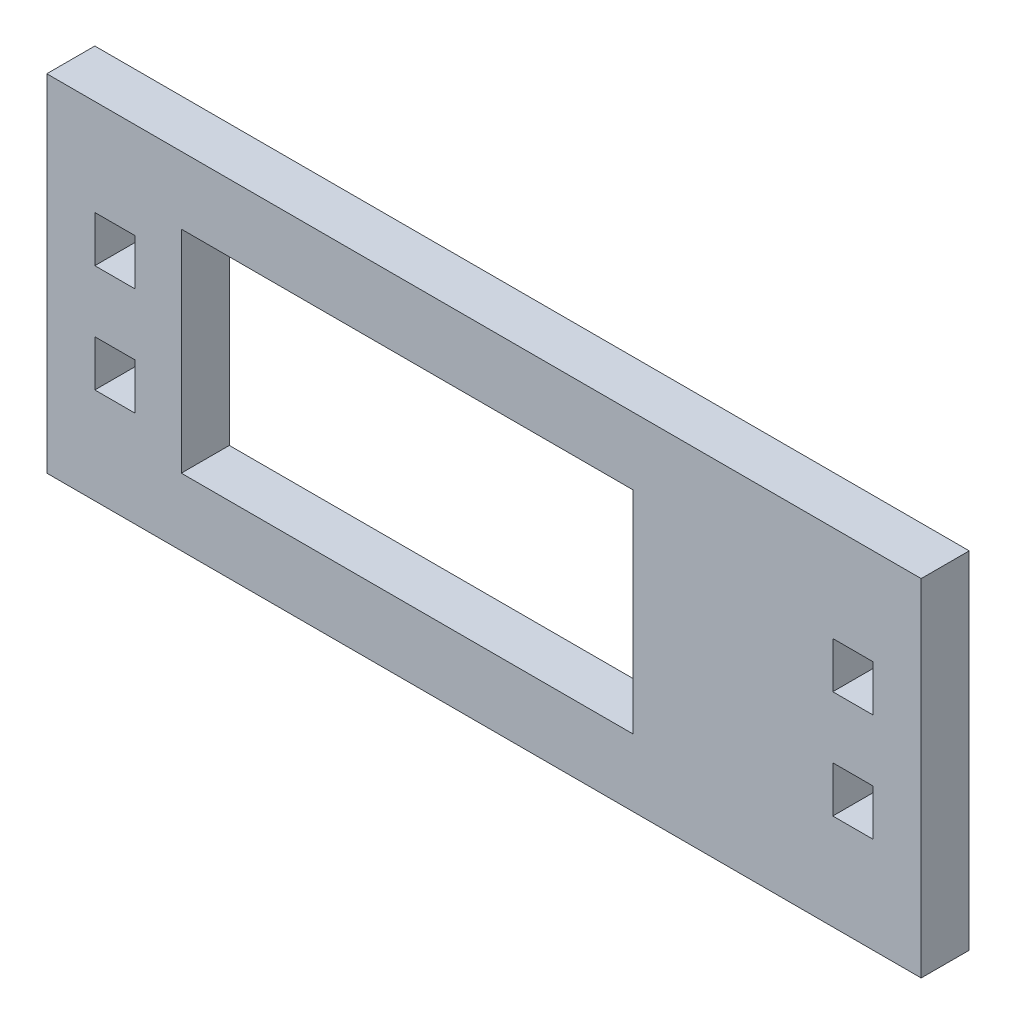
ISO-10303-21;
HEADER;
FILE_DESCRIPTION(('STEP AP214'),'2;1');
FILE_NAME('part.step','',(''),(''),'','','');
FILE_SCHEMA(('AUTOMOTIVE_DESIGN { 1 0 10303 214 1 1 1 1 }'));
ENDSEC;
DATA;
#1=APPLICATION_CONTEXT('core data for automotive mechanical design processes');
#2=APPLICATION_PROTOCOL_DEFINITION('international standard','automotive_design',2000,#1);
#3=PRODUCT_CONTEXT('',#1,'mechanical');
#4=PRODUCT('Part','Part','',(#3));
#5=PRODUCT_RELATED_PRODUCT_CATEGORY('part','',(#4));
#6=PRODUCT_DEFINITION_FORMATION('','',#4);
#7=PRODUCT_DEFINITION_CONTEXT('part definition',#1,'design');
#8=PRODUCT_DEFINITION('design','',#6,#7);
#9=PRODUCT_DEFINITION_SHAPE('','',#8);
#10=(LENGTH_UNIT() NAMED_UNIT(*) SI_UNIT(.MILLI.,.METRE.));
#11=(NAMED_UNIT(*) PLANE_ANGLE_UNIT() SI_UNIT($,.RADIAN.));
#12=(NAMED_UNIT(*) SI_UNIT($,.STERADIAN.) SOLID_ANGLE_UNIT());
#13=UNCERTAINTY_MEASURE_WITH_UNIT(LENGTH_MEASURE(1.E-05),#10,'distance_accuracy_value','');
#14=(GEOMETRIC_REPRESENTATION_CONTEXT(3) GLOBAL_UNCERTAINTY_ASSIGNED_CONTEXT((#13)) GLOBAL_UNIT_ASSIGNED_CONTEXT((#10,
#11,#12)) REPRESENTATION_CONTEXT('',''));
#15=CARTESIAN_POINT('',(0.,0.,0.));
#16=DIRECTION('',(0.,0.,1.));
#17=DIRECTION('',(1.,0.,0.));
#18=AXIS2_PLACEMENT_3D('',#15,#16,#17);
#19=CARTESIAN_POINT('',(57.785,-22.86,6.35));
#20=DIRECTION('',(-1.,0.,0.));
#21=DIRECTION('',(0.,0.,1.));
#22=AXIS2_PLACEMENT_3D('',#19,#20,#21);
#23=PLANE('',#22);
#24=DIRECTION('',(0.,1.,0.));
#25=VECTOR('',#24,1.);
#26=CARTESIAN_POINT('',(57.785,-22.86,0.));
#27=LINE('',#26,#25);
#28=CARTESIAN_POINT('',(57.785,-22.86,0.));
#29=VERTEX_POINT('',#28);
#30=CARTESIAN_POINT('',(57.785,22.86,0.));
#31=VERTEX_POINT('',#30);
#32=EDGE_CURVE('E397',#29,#31,#27,.T.);
#33=ORIENTED_EDGE('',*,*,#32,.T.);
#34=DIRECTION('',(0.,0.,-1.));
#35=VECTOR('',#34,1.);
#36=CARTESIAN_POINT('',(57.785,22.86,6.35));
#37=LINE('',#36,#35);
#38=CARTESIAN_POINT('',(57.785,22.86,6.35));
#39=VERTEX_POINT('',#38);
#40=EDGE_CURVE('E12',#39,#31,#37,.T.);
#41=ORIENTED_EDGE('',*,*,#40,.F.);
#42=DIRECTION('',(0.,1.,0.));
#43=VECTOR('',#42,1.);
#44=CARTESIAN_POINT('',(57.785,-22.86,6.35));
#45=LINE('',#44,#43);
#46=CARTESIAN_POINT('',(57.785,-22.86,6.35));
#47=VERTEX_POINT('',#46);
#48=EDGE_CURVE('E404',#47,#39,#45,.T.);
#49=ORIENTED_EDGE('',*,*,#48,.F.);
#50=DIRECTION('',(0.,0.,-1.));
#51=VECTOR('',#50,1.);
#52=CARTESIAN_POINT('',(57.785,-22.86,6.35));
#53=LINE('',#52,#51);
#54=EDGE_CURVE('E421',#47,#29,#53,.T.);
#55=ORIENTED_EDGE('',*,*,#54,.T.);
#56=EDGE_LOOP('',(#33,#41,#49,#55));
#57=FACE_BOUND('',#56,.T.);
#58=ADVANCED_FACE('F37',(#57),#23,.F.);
#59=CARTESIAN_POINT('',(-57.785,22.86,6.35));
#60=DIRECTION('',(0.,-1.,0.));
#61=DIRECTION('',(0.,0.,-1.));
#62=AXIS2_PLACEMENT_3D('',#59,#60,#61);
#63=PLANE('',#62);
#64=DIRECTION('',(-1.,0.,0.));
#65=VECTOR('',#64,1.);
#66=CARTESIAN_POINT('',(-57.785,22.86,0.));
#67=LINE('',#66,#65);
#68=CARTESIAN_POINT('',(-57.785,22.86,0.));
#69=VERTEX_POINT('',#68);
#70=EDGE_CURVE('E424',#31,#69,#67,.T.);
#71=ORIENTED_EDGE('',*,*,#70,.T.);
#72=DIRECTION('',(0.,0.,-1.));
#73=VECTOR('',#72,1.);
#74=CARTESIAN_POINT('',(-57.785,22.86,6.35));
#75=LINE('',#74,#73);
#76=CARTESIAN_POINT('',(-57.785,22.86,6.35));
#77=VERTEX_POINT('',#76);
#78=EDGE_CURVE('E44',#77,#69,#75,.T.);
#79=ORIENTED_EDGE('',*,*,#78,.F.);
#80=DIRECTION('',(-1.,0.,0.));
#81=VECTOR('',#80,1.);
#82=CARTESIAN_POINT('',(-57.785,22.86,6.35));
#83=LINE('',#82,#81);
#84=EDGE_CURVE('E409',#39,#77,#83,.T.);
#85=ORIENTED_EDGE('',*,*,#84,.F.);
#86=ORIENTED_EDGE('',*,*,#40,.T.);
#87=EDGE_LOOP('',(#71,#79,#85,#86));
#88=FACE_BOUND('',#87,.T.);
#89=ADVANCED_FACE('F490',(#88),#63,.F.);
#90=CARTESIAN_POINT('',(-57.785,-22.86,6.35));
#91=DIRECTION('',(1.,0.,0.));
#92=DIRECTION('',(0.,0.,-1.));
#93=AXIS2_PLACEMENT_3D('',#90,#91,#92);
#94=PLANE('',#93);
#95=DIRECTION('',(0.,-1.,0.));
#96=VECTOR('',#95,1.);
#97=CARTESIAN_POINT('',(-57.785,-22.86,0.));
#98=LINE('',#97,#96);
#99=CARTESIAN_POINT('',(-57.785,-22.86,0.));
#100=VERTEX_POINT('',#99);
#101=EDGE_CURVE('E426',#69,#100,#98,.T.);
#102=ORIENTED_EDGE('',*,*,#101,.T.);
#103=DIRECTION('',(0.,0.,-1.));
#104=VECTOR('',#103,1.);
#105=CARTESIAN_POINT('',(-57.785,-22.86,6.35));
#106=LINE('',#105,#104);
#107=CARTESIAN_POINT('',(-57.785,-22.86,6.35));
#108=VERTEX_POINT('',#107);
#109=EDGE_CURVE('E431',#108,#100,#106,.T.);
#110=ORIENTED_EDGE('',*,*,#109,.F.);
#111=DIRECTION('',(0.,-1.,0.));
#112=VECTOR('',#111,1.);
#113=CARTESIAN_POINT('',(-57.785,-22.86,6.35));
#114=LINE('',#113,#112);
#115=EDGE_CURVE('E414',#77,#108,#114,.T.);
#116=ORIENTED_EDGE('',*,*,#115,.F.);
#117=ORIENTED_EDGE('',*,*,#78,.T.);
#118=EDGE_LOOP('',(#102,#110,#116,#117));
#119=FACE_BOUND('',#118,.T.);
#120=ADVANCED_FACE('F438',(#119),#94,.F.);
#121=CARTESIAN_POINT('',(-57.785,-22.86,6.35));
#122=DIRECTION('',(0.,1.,0.));
#123=DIRECTION('',(0.,0.,1.));
#124=AXIS2_PLACEMENT_3D('',#121,#122,#123);
#125=PLANE('',#124);
#126=DIRECTION('',(1.,0.,0.));
#127=VECTOR('',#126,1.);
#128=CARTESIAN_POINT('',(-57.785,-22.86,0.));
#129=LINE('',#128,#127);
#130=EDGE_CURVE('E410',#100,#29,#129,.T.);
#131=ORIENTED_EDGE('',*,*,#130,.T.);
#132=ORIENTED_EDGE('',*,*,#54,.F.);
#133=DIRECTION('',(1.,0.,0.));
#134=VECTOR('',#133,1.);
#135=CARTESIAN_POINT('',(-57.785,-22.86,6.35));
#136=LINE('',#135,#134);
#137=EDGE_CURVE('E417',#108,#47,#136,.T.);
#138=ORIENTED_EDGE('',*,*,#137,.F.);
#139=ORIENTED_EDGE('',*,*,#109,.T.);
#140=EDGE_LOOP('',(#131,#132,#138,#139));
#141=FACE_BOUND('',#140,.T.);
#142=ADVANCED_FACE('F446',(#141),#125,.F.);
#143=CARTESIAN_POINT('',(0.,0.,6.35));
#144=DIRECTION('',(0.,0.,-1.));
#145=DIRECTION('',(-1.,0.,0.));
#146=AXIS2_PLACEMENT_3D('',#143,#144,#145);
#147=PLANE('',#146);
#148=DIRECTION('',(0.,-1.,0.));
#149=VECTOR('',#148,1.);
#150=CARTESIAN_POINT('',(46.101,10.16,6.35));
#151=LINE('',#150,#149);
#152=CARTESIAN_POINT('',(46.101,10.16,6.35));
#153=VERTEX_POINT('',#152);
#154=CARTESIAN_POINT('',(46.101,4.06400000000001,6.35));
#155=VERTEX_POINT('',#154);
#156=EDGE_CURVE('E227',#153,#155,#151,.T.);
#157=ORIENTED_EDGE('',*,*,#156,.F.);
#158=DIRECTION('',(-1.,0.,0.));
#159=VECTOR('',#158,1.);
#160=CARTESIAN_POINT('',(51.435,10.16,6.35));
#161=LINE('',#160,#159);
#162=CARTESIAN_POINT('',(51.435,10.16,6.35));
#163=VERTEX_POINT('',#162);
#164=EDGE_CURVE('E51',#163,#153,#161,.T.);
#165=ORIENTED_EDGE('',*,*,#164,.F.);
#166=DIRECTION('',(0.,1.,0.));
#167=VECTOR('',#166,1.);
#168=CARTESIAN_POINT('',(51.435,10.16,6.35));
#169=LINE('',#168,#167);
#170=CARTESIAN_POINT('',(51.435,4.06399999999999,6.35));
#171=VERTEX_POINT('',#170);
#172=EDGE_CURVE('E215',#171,#163,#169,.T.);
#173=ORIENTED_EDGE('',*,*,#172,.F.);
#174=DIRECTION('',(1.,0.,0.));
#175=VECTOR('',#174,1.);
#176=CARTESIAN_POINT('',(51.435,4.06399999999999,6.35));
#177=LINE('',#176,#175);
#178=EDGE_CURVE('E219',#155,#171,#177,.T.);
#179=ORIENTED_EDGE('',*,*,#178,.F.);
#180=EDGE_LOOP('',(#157,#165,#173,#179));
#181=FACE_BOUND('',#180,.T.);
#182=DIRECTION('',(-1.,0.,0.));
#183=VECTOR('',#182,1.);
#184=CARTESIAN_POINT('',(51.435,-4.06399999999999,6.35));
#185=LINE('',#184,#183);
#186=CARTESIAN_POINT('',(51.435,-4.06399999999999,6.35));
#187=VERTEX_POINT('',#186);
#188=CARTESIAN_POINT('',(46.101,-4.06400000000001,6.35));
#189=VERTEX_POINT('',#188);
#190=EDGE_CURVE('E261',#187,#189,#185,.T.);
#191=ORIENTED_EDGE('',*,*,#190,.F.);
#192=DIRECTION('',(0.,1.,0.));
#193=VECTOR('',#192,1.);
#194=CARTESIAN_POINT('',(51.435,-10.16,6.35));
#195=LINE('',#194,#193);
#196=CARTESIAN_POINT('',(51.435,-10.16,6.35));
#197=VERTEX_POINT('',#196);
#198=EDGE_CURVE('E240',#197,#187,#195,.T.);
#199=ORIENTED_EDGE('',*,*,#198,.F.);
#200=DIRECTION('',(1.,0.,0.));
#201=VECTOR('',#200,1.);
#202=CARTESIAN_POINT('',(51.435,-10.16,6.35));
#203=LINE('',#202,#201);
#204=CARTESIAN_POINT('',(46.101,-10.16,6.35));
#205=VERTEX_POINT('',#204);
#206=EDGE_CURVE('E248',#205,#197,#203,.T.);
#207=ORIENTED_EDGE('',*,*,#206,.F.);
#208=DIRECTION('',(0.,-1.,0.));
#209=VECTOR('',#208,1.);
#210=CARTESIAN_POINT('',(46.101,-10.16,6.35));
#211=LINE('',#210,#209);
#212=EDGE_CURVE('E273',#189,#205,#211,.T.);
#213=ORIENTED_EDGE('',*,*,#212,.F.);
#214=EDGE_LOOP('',(#191,#199,#207,#213));
#215=FACE_BOUND('',#214,.T.);
#216=DIRECTION('',(0.,1.,0.));
#217=VECTOR('',#216,1.);
#218=CARTESIAN_POINT('',(-46.101,-10.16,6.35));
#219=LINE('',#218,#217);
#220=CARTESIAN_POINT('',(-46.101,-10.16,6.35));
#221=VERTEX_POINT('',#220);
#222=CARTESIAN_POINT('',(-46.101,-4.064,6.35));
#223=VERTEX_POINT('',#222);
#224=EDGE_CURVE('E301',#221,#223,#219,.T.);
#225=ORIENTED_EDGE('',*,*,#224,.F.);
#226=DIRECTION('',(1.,0.,0.));
#227=VECTOR('',#226,1.);
#228=CARTESIAN_POINT('',(-51.435,-10.16,6.35));
#229=LINE('',#228,#227);
#230=CARTESIAN_POINT('',(-51.435,-10.16,6.35));
#231=VERTEX_POINT('',#230);
#232=EDGE_CURVE('E277',#231,#221,#229,.T.);
#233=ORIENTED_EDGE('',*,*,#232,.F.);
#234=DIRECTION('',(0.,-1.,0.));
#235=VECTOR('',#234,1.);
#236=CARTESIAN_POINT('',(-51.435,-10.16,6.35));
#237=LINE('',#236,#235);
#238=CARTESIAN_POINT('',(-51.435,-4.064,6.35));
#239=VERTEX_POINT('',#238);
#240=EDGE_CURVE('E288',#239,#231,#237,.T.);
#241=ORIENTED_EDGE('',*,*,#240,.F.);
#242=DIRECTION('',(-1.,0.,0.));
#243=VECTOR('',#242,1.);
#244=CARTESIAN_POINT('',(-51.435,-4.064,6.35));
#245=LINE('',#244,#243);
#246=EDGE_CURVE('E313',#223,#239,#245,.T.);
#247=ORIENTED_EDGE('',*,*,#246,.F.);
#248=EDGE_LOOP('',(#225,#233,#241,#247));
#249=FACE_BOUND('',#248,.T.);
#250=DIRECTION('',(1.,0.,0.));
#251=VECTOR('',#250,1.);
#252=CARTESIAN_POINT('',(-51.435,4.064,6.35));
#253=LINE('',#252,#251);
#254=CARTESIAN_POINT('',(-51.435,4.064,6.35));
#255=VERTEX_POINT('',#254);
#256=CARTESIAN_POINT('',(-46.101,4.064,6.35));
#257=VERTEX_POINT('',#256);
#258=EDGE_CURVE('E341',#255,#257,#253,.T.);
#259=ORIENTED_EDGE('',*,*,#258,.F.);
#260=DIRECTION('',(0.,-1.,0.));
#261=VECTOR('',#260,1.);
#262=CARTESIAN_POINT('',(-51.435,10.16,6.35));
#263=LINE('',#262,#261);
#264=CARTESIAN_POINT('',(-51.435,10.16,6.35));
#265=VERTEX_POINT('',#264);
#266=EDGE_CURVE('E317',#265,#255,#263,.T.);
#267=ORIENTED_EDGE('',*,*,#266,.F.);
#268=DIRECTION('',(-1.,0.,0.));
#269=VECTOR('',#268,1.);
#270=CARTESIAN_POINT('',(-51.435,10.16,6.35));
#271=LINE('',#270,#269);
#272=CARTESIAN_POINT('',(-46.101,10.16,6.35));
#273=VERTEX_POINT('',#272);
#274=EDGE_CURVE('E328',#273,#265,#271,.T.);
#275=ORIENTED_EDGE('',*,*,#274,.F.);
#276=DIRECTION('',(0.,1.,0.));
#277=VECTOR('',#276,1.);
#278=CARTESIAN_POINT('',(-46.101,10.16,6.35));
#279=LINE('',#278,#277);
#280=EDGE_CURVE('E353',#257,#273,#279,.T.);
#281=ORIENTED_EDGE('',*,*,#280,.F.);
#282=EDGE_LOOP('',(#259,#267,#275,#281));
#283=FACE_BOUND('',#282,.T.);
#284=DIRECTION('',(-1.,0.,0.));
#285=VECTOR('',#284,1.);
#286=CARTESIAN_POINT('',(-40.005,13.97,6.35));
#287=LINE('',#286,#285);
#288=CARTESIAN_POINT('',(19.685,13.97,6.35));
#289=VERTEX_POINT('',#288);
#290=CARTESIAN_POINT('',(-40.005,13.97,6.35));
#291=VERTEX_POINT('',#290);
#292=EDGE_CURVE('E381',#289,#291,#287,.T.);
#293=ORIENTED_EDGE('',*,*,#292,.F.);
#294=DIRECTION('',(0.,1.,0.));
#295=VECTOR('',#294,1.);
#296=CARTESIAN_POINT('',(19.685,-13.97,6.35));
#297=LINE('',#296,#295);
#298=CARTESIAN_POINT('',(19.685,-13.97,6.35));
#299=VERTEX_POINT('',#298);
#300=EDGE_CURVE('E357',#299,#289,#297,.T.);
#301=ORIENTED_EDGE('',*,*,#300,.F.);
#302=DIRECTION('',(1.,0.,0.));
#303=VECTOR('',#302,1.);
#304=CARTESIAN_POINT('',(-40.005,-13.97,6.35));
#305=LINE('',#304,#303);
#306=CARTESIAN_POINT('',(-40.005,-13.97,6.35));
#307=VERTEX_POINT('',#306);
#308=EDGE_CURVE('E368',#307,#299,#305,.T.);
#309=ORIENTED_EDGE('',*,*,#308,.F.);
#310=DIRECTION('',(0.,-1.,0.));
#311=VECTOR('',#310,1.);
#312=CARTESIAN_POINT('',(-40.005,-13.97,6.35));
#313=LINE('',#312,#311);
#314=EDGE_CURVE('E393',#291,#307,#313,.T.);
#315=ORIENTED_EDGE('',*,*,#314,.F.);
#316=EDGE_LOOP('',(#293,#301,#309,#315));
#317=FACE_BOUND('',#316,.T.);
#318=ORIENTED_EDGE('',*,*,#48,.T.);
#319=ORIENTED_EDGE('',*,*,#84,.T.);
#320=ORIENTED_EDGE('',*,*,#115,.T.);
#321=ORIENTED_EDGE('',*,*,#137,.T.);
#322=EDGE_LOOP('',(#318,#319,#320,#321));
#323=FACE_BOUND('',#322,.T.);
#324=ADVANCED_FACE('F452',(#181,#215,#249,#283,#317,#323),#147,.F.);
#325=CARTESIAN_POINT('',(0.,0.,0.));
#326=DIRECTION('',(0.,0.,-1.));
#327=DIRECTION('',(-1.,0.,0.));
#328=AXIS2_PLACEMENT_3D('',#325,#326,#327);
#329=PLANE('',#328);
#330=DIRECTION('',(-1.,0.,0.));
#331=VECTOR('',#330,1.);
#332=CARTESIAN_POINT('',(51.435,10.16,0.));
#333=LINE('',#332,#331);
#334=CARTESIAN_POINT('',(51.435,10.16,0.));
#335=VERTEX_POINT('',#334);
#336=CARTESIAN_POINT('',(46.101,10.16,0.));
#337=VERTEX_POINT('',#336);
#338=EDGE_CURVE('E199',#335,#337,#333,.T.);
#339=ORIENTED_EDGE('',*,*,#338,.T.);
#340=DIRECTION('',(0.,-1.,0.));
#341=VECTOR('',#340,1.);
#342=CARTESIAN_POINT('',(46.101,10.16,0.));
#343=LINE('',#342,#341);
#344=CARTESIAN_POINT('',(46.101,4.06400000000001,0.));
#345=VERTEX_POINT('',#344);
#346=EDGE_CURVE('E208',#337,#345,#343,.T.);
#347=ORIENTED_EDGE('',*,*,#346,.T.);
#348=DIRECTION('',(1.,0.,0.));
#349=VECTOR('',#348,1.);
#350=CARTESIAN_POINT('',(51.435,4.06399999999999,0.));
#351=LINE('',#350,#349);
#352=CARTESIAN_POINT('',(51.435,4.06399999999999,0.));
#353=VERTEX_POINT('',#352);
#354=EDGE_CURVE('E59',#345,#353,#351,.T.);
#355=ORIENTED_EDGE('',*,*,#354,.T.);
#356=DIRECTION('',(0.,1.,0.));
#357=VECTOR('',#356,1.);
#358=CARTESIAN_POINT('',(51.435,10.16,0.));
#359=LINE('',#358,#357);
#360=EDGE_CURVE('E205',#353,#335,#359,.T.);
#361=ORIENTED_EDGE('',*,*,#360,.T.);
#362=EDGE_LOOP('',(#339,#347,#355,#361));
#363=FACE_BOUND('',#362,.T.);
#364=DIRECTION('',(0.,1.,0.));
#365=VECTOR('',#364,1.);
#366=CARTESIAN_POINT('',(51.435,-10.16,0.));
#367=LINE('',#366,#365);
#368=CARTESIAN_POINT('',(51.435,-10.16,0.));
#369=VERTEX_POINT('',#368);
#370=CARTESIAN_POINT('',(51.435,-4.06399999999999,0.));
#371=VERTEX_POINT('',#370);
#372=EDGE_CURVE('E244',#369,#371,#367,.T.);
#373=ORIENTED_EDGE('',*,*,#372,.T.);
#374=DIRECTION('',(-1.,0.,0.));
#375=VECTOR('',#374,1.);
#376=CARTESIAN_POINT('',(51.435,-4.06399999999999,0.));
#377=LINE('',#376,#375);
#378=CARTESIAN_POINT('',(46.101,-4.06400000000001,0.));
#379=VERTEX_POINT('',#378);
#380=EDGE_CURVE('E247',#371,#379,#377,.T.);
#381=ORIENTED_EDGE('',*,*,#380,.T.);
#382=DIRECTION('',(0.,-1.,0.));
#383=VECTOR('',#382,1.);
#384=CARTESIAN_POINT('',(46.101,-10.16,0.));
#385=LINE('',#384,#383);
#386=CARTESIAN_POINT('',(46.101,-10.16,0.));
#387=VERTEX_POINT('',#386);
#388=EDGE_CURVE('E251',#379,#387,#385,.T.);
#389=ORIENTED_EDGE('',*,*,#388,.T.);
#390=DIRECTION('',(1.,0.,0.));
#391=VECTOR('',#390,1.);
#392=CARTESIAN_POINT('',(51.435,-10.16,0.));
#393=LINE('',#392,#391);
#394=EDGE_CURVE('E254',#387,#369,#393,.T.);
#395=ORIENTED_EDGE('',*,*,#394,.T.);
#396=EDGE_LOOP('',(#373,#381,#389,#395));
#397=FACE_BOUND('',#396,.T.);
#398=DIRECTION('',(1.,0.,0.));
#399=VECTOR('',#398,1.);
#400=CARTESIAN_POINT('',(-51.435,-10.16,0.));
#401=LINE('',#400,#399);
#402=CARTESIAN_POINT('',(-51.435,-10.16,0.));
#403=VERTEX_POINT('',#402);
#404=CARTESIAN_POINT('',(-46.101,-10.16,0.));
#405=VERTEX_POINT('',#404);
#406=EDGE_CURVE('E284',#403,#405,#401,.T.);
#407=ORIENTED_EDGE('',*,*,#406,.T.);
#408=DIRECTION('',(0.,1.,0.));
#409=VECTOR('',#408,1.);
#410=CARTESIAN_POINT('',(-46.101,-10.16,0.));
#411=LINE('',#410,#409);
#412=CARTESIAN_POINT('',(-46.101,-4.064,0.));
#413=VERTEX_POINT('',#412);
#414=EDGE_CURVE('E287',#405,#413,#411,.T.);
#415=ORIENTED_EDGE('',*,*,#414,.T.);
#416=DIRECTION('',(-1.,0.,0.));
#417=VECTOR('',#416,1.);
#418=CARTESIAN_POINT('',(-51.435,-4.064,0.));
#419=LINE('',#418,#417);
#420=CARTESIAN_POINT('',(-51.435,-4.064,0.));
#421=VERTEX_POINT('',#420);
#422=EDGE_CURVE('E291',#413,#421,#419,.T.);
#423=ORIENTED_EDGE('',*,*,#422,.T.);
#424=DIRECTION('',(0.,-1.,0.));
#425=VECTOR('',#424,1.);
#426=CARTESIAN_POINT('',(-51.435,-10.16,0.));
#427=LINE('',#426,#425);
#428=EDGE_CURVE('E294',#421,#403,#427,.T.);
#429=ORIENTED_EDGE('',*,*,#428,.T.);
#430=EDGE_LOOP('',(#407,#415,#423,#429));
#431=FACE_BOUND('',#430,.T.);
#432=DIRECTION('',(0.,-1.,0.));
#433=VECTOR('',#432,1.);
#434=CARTESIAN_POINT('',(-51.435,10.16,0.));
#435=LINE('',#434,#433);
#436=CARTESIAN_POINT('',(-51.435,10.16,0.));
#437=VERTEX_POINT('',#436);
#438=CARTESIAN_POINT('',(-51.435,4.064,0.));
#439=VERTEX_POINT('',#438);
#440=EDGE_CURVE('E324',#437,#439,#435,.T.);
#441=ORIENTED_EDGE('',*,*,#440,.T.);
#442=DIRECTION('',(1.,0.,0.));
#443=VECTOR('',#442,1.);
#444=CARTESIAN_POINT('',(-51.435,4.064,0.));
#445=LINE('',#444,#443);
#446=CARTESIAN_POINT('',(-46.101,4.064,0.));
#447=VERTEX_POINT('',#446);
#448=EDGE_CURVE('E327',#439,#447,#445,.T.);
#449=ORIENTED_EDGE('',*,*,#448,.T.);
#450=DIRECTION('',(0.,1.,0.));
#451=VECTOR('',#450,1.);
#452=CARTESIAN_POINT('',(-46.101,10.16,0.));
#453=LINE('',#452,#451);
#454=CARTESIAN_POINT('',(-46.101,10.16,0.));
#455=VERTEX_POINT('',#454);
#456=EDGE_CURVE('E331',#447,#455,#453,.T.);
#457=ORIENTED_EDGE('',*,*,#456,.T.);
#458=DIRECTION('',(-1.,0.,0.));
#459=VECTOR('',#458,1.);
#460=CARTESIAN_POINT('',(-51.435,10.16,0.));
#461=LINE('',#460,#459);
#462=EDGE_CURVE('E334',#455,#437,#461,.T.);
#463=ORIENTED_EDGE('',*,*,#462,.T.);
#464=EDGE_LOOP('',(#441,#449,#457,#463));
#465=FACE_BOUND('',#464,.T.);
#466=DIRECTION('',(0.,1.,0.));
#467=VECTOR('',#466,1.);
#468=CARTESIAN_POINT('',(19.685,-13.97,0.));
#469=LINE('',#468,#467);
#470=CARTESIAN_POINT('',(19.685,-13.97,0.));
#471=VERTEX_POINT('',#470);
#472=CARTESIAN_POINT('',(19.685,13.97,0.));
#473=VERTEX_POINT('',#472);
#474=EDGE_CURVE('E364',#471,#473,#469,.T.);
#475=ORIENTED_EDGE('',*,*,#474,.T.);
#476=DIRECTION('',(-1.,0.,0.));
#477=VECTOR('',#476,1.);
#478=CARTESIAN_POINT('',(-40.005,13.97,0.));
#479=LINE('',#478,#477);
#480=CARTESIAN_POINT('',(-40.005,13.97,0.));
#481=VERTEX_POINT('',#480);
#482=EDGE_CURVE('E367',#473,#481,#479,.T.);
#483=ORIENTED_EDGE('',*,*,#482,.T.);
#484=DIRECTION('',(0.,-1.,0.));
#485=VECTOR('',#484,1.);
#486=CARTESIAN_POINT('',(-40.005,-13.97,0.));
#487=LINE('',#486,#485);
#488=CARTESIAN_POINT('',(-40.005,-13.97,0.));
#489=VERTEX_POINT('',#488);
#490=EDGE_CURVE('E371',#481,#489,#487,.T.);
#491=ORIENTED_EDGE('',*,*,#490,.T.);
#492=DIRECTION('',(1.,0.,0.));
#493=VECTOR('',#492,1.);
#494=CARTESIAN_POINT('',(-40.005,-13.97,0.));
#495=LINE('',#494,#493);
#496=EDGE_CURVE('E374',#489,#471,#495,.T.);
#497=ORIENTED_EDGE('',*,*,#496,.T.);
#498=EDGE_LOOP('',(#475,#483,#491,#497));
#499=FACE_BOUND('',#498,.T.);
#500=ORIENTED_EDGE('',*,*,#32,.F.);
#501=ORIENTED_EDGE('',*,*,#130,.F.);
#502=ORIENTED_EDGE('',*,*,#101,.F.);
#503=ORIENTED_EDGE('',*,*,#70,.F.);
#504=EDGE_LOOP('',(#500,#501,#502,#503));
#505=FACE_BOUND('',#504,.T.);
#506=ADVANCED_FACE('F212',(#363,#397,#431,#465,#499,#505),#329,.T.);
#507=CARTESIAN_POINT('',(19.685,-13.97,0.));
#508=DIRECTION('',(1.,0.,0.));
#509=DIRECTION('',(0.,0.,-1.));
#510=AXIS2_PLACEMENT_3D('',#507,#508,#509);
#511=PLANE('',#510);
#512=ORIENTED_EDGE('',*,*,#300,.T.);
#513=DIRECTION('',(0.,0.,1.));
#514=VECTOR('',#513,1.);
#515=CARTESIAN_POINT('',(19.685,13.97,0.));
#516=LINE('',#515,#514);
#517=EDGE_CURVE('E377',#473,#289,#516,.T.);
#518=ORIENTED_EDGE('',*,*,#517,.F.);
#519=ORIENTED_EDGE('',*,*,#474,.F.);
#520=DIRECTION('',(0.,0.,1.));
#521=VECTOR('',#520,1.);
#522=CARTESIAN_POINT('',(19.685,-13.97,0.));
#523=LINE('',#522,#521);
#524=EDGE_CURVE('E395',#471,#299,#523,.T.);
#525=ORIENTED_EDGE('',*,*,#524,.T.);
#526=EDGE_LOOP('',(#512,#518,#519,#525));
#527=FACE_BOUND('',#526,.T.);
#528=ADVANCED_FACE('F503',(#527),#511,.F.);
#529=CARTESIAN_POINT('',(-40.005,-13.97,0.));
#530=DIRECTION('',(0.,-1.,0.));
#531=DIRECTION('',(0.,0.,-1.));
#532=AXIS2_PLACEMENT_3D('',#529,#530,#531);
#533=PLANE('',#532);
#534=ORIENTED_EDGE('',*,*,#308,.T.);
#535=ORIENTED_EDGE('',*,*,#524,.F.);
#536=ORIENTED_EDGE('',*,*,#496,.F.);
#537=DIRECTION('',(0.,0.,1.));
#538=VECTOR('',#537,1.);
#539=CARTESIAN_POINT('',(-40.005,-13.97,0.));
#540=LINE('',#539,#538);
#541=EDGE_CURVE('E398',#489,#307,#540,.T.);
#542=ORIENTED_EDGE('',*,*,#541,.T.);
#543=EDGE_LOOP('',(#534,#535,#536,#542));
#544=FACE_BOUND('',#543,.T.);
#545=ADVANCED_FACE('F508',(#544),#533,.F.);
#546=CARTESIAN_POINT('',(-40.005,-13.97,0.));
#547=DIRECTION('',(-1.,0.,0.));
#548=DIRECTION('',(0.,0.,1.));
#549=AXIS2_PLACEMENT_3D('',#546,#547,#548);
#550=PLANE('',#549);
#551=ORIENTED_EDGE('',*,*,#314,.T.);
#552=ORIENTED_EDGE('',*,*,#541,.F.);
#553=ORIENTED_EDGE('',*,*,#490,.F.);
#554=DIRECTION('',(0.,0.,1.));
#555=VECTOR('',#554,1.);
#556=CARTESIAN_POINT('',(-40.005,13.97,0.));
#557=LINE('',#556,#555);
#558=EDGE_CURVE('E400',#481,#291,#557,.T.);
#559=ORIENTED_EDGE('',*,*,#558,.T.);
#560=EDGE_LOOP('',(#551,#552,#553,#559));
#561=FACE_BOUND('',#560,.T.);
#562=ADVANCED_FACE('F514',(#561),#550,.F.);
#563=CARTESIAN_POINT('',(-40.005,13.97,0.));
#564=DIRECTION('',(0.,1.,0.));
#565=DIRECTION('',(0.,0.,1.));
#566=AXIS2_PLACEMENT_3D('',#563,#564,#565);
#567=PLANE('',#566);
#568=ORIENTED_EDGE('',*,*,#292,.T.);
#569=ORIENTED_EDGE('',*,*,#558,.F.);
#570=ORIENTED_EDGE('',*,*,#482,.F.);
#571=ORIENTED_EDGE('',*,*,#517,.T.);
#572=EDGE_LOOP('',(#568,#569,#570,#571));
#573=FACE_BOUND('',#572,.T.);
#574=ADVANCED_FACE('F510',(#573),#567,.F.);
#575=CARTESIAN_POINT('',(-51.435,10.16,0.));
#576=DIRECTION('',(-1.,0.,0.));
#577=DIRECTION('',(0.,0.,1.));
#578=AXIS2_PLACEMENT_3D('',#575,#576,#577);
#579=PLANE('',#578);
#580=ORIENTED_EDGE('',*,*,#266,.T.);
#581=DIRECTION('',(0.,0.,1.));
#582=VECTOR('',#581,1.);
#583=CARTESIAN_POINT('',(-51.435,4.064,0.));
#584=LINE('',#583,#582);
#585=EDGE_CURVE('E337',#439,#255,#584,.T.);
#586=ORIENTED_EDGE('',*,*,#585,.F.);
#587=ORIENTED_EDGE('',*,*,#440,.F.);
#588=DIRECTION('',(0.,0.,1.));
#589=VECTOR('',#588,1.);
#590=CARTESIAN_POINT('',(-51.435,10.16,0.));
#591=LINE('',#590,#589);
#592=EDGE_CURVE('E355',#437,#265,#591,.T.);
#593=ORIENTED_EDGE('',*,*,#592,.T.);
#594=EDGE_LOOP('',(#580,#586,#587,#593));
#595=FACE_BOUND('',#594,.T.);
#596=ADVANCED_FACE('F513',(#595),#579,.F.);
#597=CARTESIAN_POINT('',(-51.435,10.16,0.));
#598=DIRECTION('',(0.,1.,0.));
#599=DIRECTION('',(0.,0.,1.));
#600=AXIS2_PLACEMENT_3D('',#597,#598,#599);
#601=PLANE('',#600);
#602=ORIENTED_EDGE('',*,*,#274,.T.);
#603=ORIENTED_EDGE('',*,*,#592,.F.);
#604=ORIENTED_EDGE('',*,*,#462,.F.);
#605=DIRECTION('',(0.,0.,1.));
#606=VECTOR('',#605,1.);
#607=CARTESIAN_POINT('',(-46.101,10.16,0.));
#608=LINE('',#607,#606);
#609=EDGE_CURVE('E358',#455,#273,#608,.T.);
#610=ORIENTED_EDGE('',*,*,#609,.T.);
#611=EDGE_LOOP('',(#602,#603,#604,#610));
#612=FACE_BOUND('',#611,.T.);
#613=ADVANCED_FACE('F524',(#612),#601,.F.);
#614=CARTESIAN_POINT('',(-46.101,10.16,0.));
#615=DIRECTION('',(1.,0.,0.));
#616=DIRECTION('',(0.,0.,-1.));
#617=AXIS2_PLACEMENT_3D('',#614,#615,#616);
#618=PLANE('',#617);
#619=ORIENTED_EDGE('',*,*,#280,.T.);
#620=ORIENTED_EDGE('',*,*,#609,.F.);
#621=ORIENTED_EDGE('',*,*,#456,.F.);
#622=DIRECTION('',(0.,0.,1.));
#623=VECTOR('',#622,1.);
#624=CARTESIAN_POINT('',(-46.101,4.064,0.));
#625=LINE('',#624,#623);
#626=EDGE_CURVE('E360',#447,#257,#625,.T.);
#627=ORIENTED_EDGE('',*,*,#626,.T.);
#628=EDGE_LOOP('',(#619,#620,#621,#627));
#629=FACE_BOUND('',#628,.T.);
#630=ADVANCED_FACE('F530',(#629),#618,.F.);
#631=CARTESIAN_POINT('',(-51.435,4.064,0.));
#632=DIRECTION('',(0.,-1.,0.));
#633=DIRECTION('',(0.,0.,-1.));
#634=AXIS2_PLACEMENT_3D('',#631,#632,#633);
#635=PLANE('',#634);
#636=ORIENTED_EDGE('',*,*,#258,.T.);
#637=ORIENTED_EDGE('',*,*,#626,.F.);
#638=ORIENTED_EDGE('',*,*,#448,.F.);
#639=ORIENTED_EDGE('',*,*,#585,.T.);
#640=EDGE_LOOP('',(#636,#637,#638,#639));
#641=FACE_BOUND('',#640,.T.);
#642=ADVANCED_FACE('F526',(#641),#635,.F.);
#643=CARTESIAN_POINT('',(-51.435,-10.16,0.));
#644=DIRECTION('',(0.,-1.,0.));
#645=DIRECTION('',(0.,0.,-1.));
#646=AXIS2_PLACEMENT_3D('',#643,#644,#645);
#647=PLANE('',#646);
#648=ORIENTED_EDGE('',*,*,#232,.T.);
#649=DIRECTION('',(0.,0.,1.));
#650=VECTOR('',#649,1.);
#651=CARTESIAN_POINT('',(-46.101,-10.16,0.));
#652=LINE('',#651,#650);
#653=EDGE_CURVE('E297',#405,#221,#652,.T.);
#654=ORIENTED_EDGE('',*,*,#653,.F.);
#655=ORIENTED_EDGE('',*,*,#406,.F.);
#656=DIRECTION('',(0.,0.,1.));
#657=VECTOR('',#656,1.);
#658=CARTESIAN_POINT('',(-51.435,-10.16,0.));
#659=LINE('',#658,#657);
#660=EDGE_CURVE('E315',#403,#231,#659,.T.);
#661=ORIENTED_EDGE('',*,*,#660,.T.);
#662=EDGE_LOOP('',(#648,#654,#655,#661));
#663=FACE_BOUND('',#662,.T.);
#664=ADVANCED_FACE('F529',(#663),#647,.F.);
#665=CARTESIAN_POINT('',(-51.435,-10.16,0.));
#666=DIRECTION('',(-1.,0.,0.));
#667=DIRECTION('',(0.,0.,1.));
#668=AXIS2_PLACEMENT_3D('',#665,#666,#667);
#669=PLANE('',#668);
#670=ORIENTED_EDGE('',*,*,#240,.T.);
#671=ORIENTED_EDGE('',*,*,#660,.F.);
#672=ORIENTED_EDGE('',*,*,#428,.F.);
#673=DIRECTION('',(0.,0.,1.));
#674=VECTOR('',#673,1.);
#675=CARTESIAN_POINT('',(-51.435,-4.064,0.));
#676=LINE('',#675,#674);
#677=EDGE_CURVE('E318',#421,#239,#676,.T.);
#678=ORIENTED_EDGE('',*,*,#677,.T.);
#679=EDGE_LOOP('',(#670,#671,#672,#678));
#680=FACE_BOUND('',#679,.T.);
#681=ADVANCED_FACE('F540',(#680),#669,.F.);
#682=CARTESIAN_POINT('',(-51.435,-4.064,0.));
#683=DIRECTION('',(0.,1.,0.));
#684=DIRECTION('',(0.,0.,1.));
#685=AXIS2_PLACEMENT_3D('',#682,#683,#684);
#686=PLANE('',#685);
#687=ORIENTED_EDGE('',*,*,#246,.T.);
#688=ORIENTED_EDGE('',*,*,#677,.F.);
#689=ORIENTED_EDGE('',*,*,#422,.F.);
#690=DIRECTION('',(0.,0.,1.));
#691=VECTOR('',#690,1.);
#692=CARTESIAN_POINT('',(-46.101,-4.064,0.));
#693=LINE('',#692,#691);
#694=EDGE_CURVE('E320',#413,#223,#693,.T.);
#695=ORIENTED_EDGE('',*,*,#694,.T.);
#696=EDGE_LOOP('',(#687,#688,#689,#695));
#697=FACE_BOUND('',#696,.T.);
#698=ADVANCED_FACE('F546',(#697),#686,.F.);
#699=CARTESIAN_POINT('',(-46.101,-10.16,0.));
#700=DIRECTION('',(1.,0.,0.));
#701=DIRECTION('',(0.,0.,-1.));
#702=AXIS2_PLACEMENT_3D('',#699,#700,#701);
#703=PLANE('',#702);
#704=ORIENTED_EDGE('',*,*,#224,.T.);
#705=ORIENTED_EDGE('',*,*,#694,.F.);
#706=ORIENTED_EDGE('',*,*,#414,.F.);
#707=ORIENTED_EDGE('',*,*,#653,.T.);
#708=EDGE_LOOP('',(#704,#705,#706,#707));
#709=FACE_BOUND('',#708,.T.);
#710=ADVANCED_FACE('F542',(#709),#703,.F.);
#711=CARTESIAN_POINT('',(51.435,-10.16,0.));
#712=DIRECTION('',(1.,0.,0.));
#713=DIRECTION('',(0.,0.,-1.));
#714=AXIS2_PLACEMENT_3D('',#711,#712,#713);
#715=PLANE('',#714);
#716=ORIENTED_EDGE('',*,*,#198,.T.);
#717=DIRECTION('',(0.,0.,1.));
#718=VECTOR('',#717,1.);
#719=CARTESIAN_POINT('',(51.435,-4.06399999999999,0.));
#720=LINE('',#719,#718);
#721=EDGE_CURVE('E257',#371,#187,#720,.T.);
#722=ORIENTED_EDGE('',*,*,#721,.F.);
#723=ORIENTED_EDGE('',*,*,#372,.F.);
#724=DIRECTION('',(0.,0.,1.));
#725=VECTOR('',#724,1.);
#726=CARTESIAN_POINT('',(51.435,-10.16,0.));
#727=LINE('',#726,#725);
#728=EDGE_CURVE('E275',#369,#197,#727,.T.);
#729=ORIENTED_EDGE('',*,*,#728,.T.);
#730=EDGE_LOOP('',(#716,#722,#723,#729));
#731=FACE_BOUND('',#730,.T.);
#732=ADVANCED_FACE('F545',(#731),#715,.F.);
#733=CARTESIAN_POINT('',(51.435,-10.16,0.));
#734=DIRECTION('',(0.,-1.,0.));
#735=DIRECTION('',(1.,0.,0.));
#736=AXIS2_PLACEMENT_3D('',#733,#734,#735);
#737=PLANE('',#736);
#738=ORIENTED_EDGE('',*,*,#206,.T.);
#739=ORIENTED_EDGE('',*,*,#728,.F.);
#740=ORIENTED_EDGE('',*,*,#394,.F.);
#741=DIRECTION('',(0.,0.,1.));
#742=VECTOR('',#741,1.);
#743=CARTESIAN_POINT('',(46.101,-10.16,0.));
#744=LINE('',#743,#742);
#745=EDGE_CURVE('E278',#387,#205,#744,.T.);
#746=ORIENTED_EDGE('',*,*,#745,.T.);
#747=EDGE_LOOP('',(#738,#739,#740,#746));
#748=FACE_BOUND('',#747,.T.);
#749=ADVANCED_FACE('F556',(#748),#737,.F.);
#750=CARTESIAN_POINT('',(46.101,-10.16,0.));
#751=DIRECTION('',(-1.,0.,0.));
#752=DIRECTION('',(0.,-1.,0.));
#753=AXIS2_PLACEMENT_3D('',#750,#751,#752);
#754=PLANE('',#753);
#755=ORIENTED_EDGE('',*,*,#212,.T.);
#756=ORIENTED_EDGE('',*,*,#745,.F.);
#757=ORIENTED_EDGE('',*,*,#388,.F.);
#758=DIRECTION('',(0.,0.,1.));
#759=VECTOR('',#758,1.);
#760=CARTESIAN_POINT('',(46.101,-4.06400000000001,0.));
#761=LINE('',#760,#759);
#762=EDGE_CURVE('E280',#379,#189,#761,.T.);
#763=ORIENTED_EDGE('',*,*,#762,.T.);
#764=EDGE_LOOP('',(#755,#756,#757,#763));
#765=FACE_BOUND('',#764,.T.);
#766=ADVANCED_FACE('F560',(#765),#754,.F.);
#767=CARTESIAN_POINT('',(51.435,-4.06399999999999,0.));
#768=DIRECTION('',(0.,1.,0.));
#769=DIRECTION('',(-1.,0.,0.));
#770=AXIS2_PLACEMENT_3D('',#767,#768,#769);
#771=PLANE('',#770);
#772=ORIENTED_EDGE('',*,*,#190,.T.);
#773=ORIENTED_EDGE('',*,*,#762,.F.);
#774=ORIENTED_EDGE('',*,*,#380,.F.);
#775=ORIENTED_EDGE('',*,*,#721,.T.);
#776=EDGE_LOOP('',(#772,#773,#774,#775));
#777=FACE_BOUND('',#776,.T.);
#778=ADVANCED_FACE('F487',(#777),#771,.F.);
#779=CARTESIAN_POINT('',(51.435,10.16,0.));
#780=DIRECTION('',(0.,1.,0.));
#781=DIRECTION('',(-1.,0.,0.));
#782=AXIS2_PLACEMENT_3D('',#779,#780,#781);
#783=PLANE('',#782);
#784=ORIENTED_EDGE('',*,*,#164,.T.);
#785=DIRECTION('',(0.,0.,1.));
#786=VECTOR('',#785,1.);
#787=CARTESIAN_POINT('',(46.101,10.16,0.));
#788=LINE('',#787,#786);
#789=EDGE_CURVE('E195',#337,#153,#788,.T.);
#790=ORIENTED_EDGE('',*,*,#789,.F.);
#791=ORIENTED_EDGE('',*,*,#338,.F.);
#792=DIRECTION('',(0.,0.,1.));
#793=VECTOR('',#792,1.);
#794=CARTESIAN_POINT('',(51.435,10.16,0.));
#795=LINE('',#794,#793);
#796=EDGE_CURVE('E238',#335,#163,#795,.T.);
#797=ORIENTED_EDGE('',*,*,#796,.T.);
#798=EDGE_LOOP('',(#784,#790,#791,#797));
#799=FACE_BOUND('',#798,.T.);
#800=ADVANCED_FACE('F197',(#799),#783,.F.);
#801=CARTESIAN_POINT('',(51.435,10.16,0.));
#802=DIRECTION('',(1.,0.,0.));
#803=DIRECTION('',(0.,0.,-1.));
#804=AXIS2_PLACEMENT_3D('',#801,#802,#803);
#805=PLANE('',#804);
#806=ORIENTED_EDGE('',*,*,#172,.T.);
#807=ORIENTED_EDGE('',*,*,#796,.F.);
#808=ORIENTED_EDGE('',*,*,#360,.F.);
#809=DIRECTION('',(0.,0.,1.));
#810=VECTOR('',#809,1.);
#811=CARTESIAN_POINT('',(51.435,4.06399999999999,0.));
#812=LINE('',#811,#810);
#813=EDGE_CURVE('E241',#353,#171,#812,.T.);
#814=ORIENTED_EDGE('',*,*,#813,.T.);
#815=EDGE_LOOP('',(#806,#807,#808,#814));
#816=FACE_BOUND('',#815,.T.);
#817=ADVANCED_FACE('F479',(#816),#805,.F.);
#818=CARTESIAN_POINT('',(51.435,4.06399999999999,0.));
#819=DIRECTION('',(0.,-1.,0.));
#820=DIRECTION('',(1.,0.,0.));
#821=AXIS2_PLACEMENT_3D('',#818,#819,#820);
#822=PLANE('',#821);
#823=ORIENTED_EDGE('',*,*,#178,.T.);
#824=ORIENTED_EDGE('',*,*,#813,.F.);
#825=ORIENTED_EDGE('',*,*,#354,.F.);
#826=DIRECTION('',(0.,0.,1.));
#827=VECTOR('',#826,1.);
#828=CARTESIAN_POINT('',(46.101,4.06400000000001,0.));
#829=LINE('',#828,#827);
#830=EDGE_CURVE('E204',#345,#155,#829,.T.);
#831=ORIENTED_EDGE('',*,*,#830,.T.);
#832=EDGE_LOOP('',(#823,#824,#825,#831));
#833=FACE_BOUND('',#832,.T.);
#834=ADVANCED_FACE('F477',(#833),#822,.F.);
#835=CARTESIAN_POINT('',(46.101,10.16,0.));
#836=DIRECTION('',(-1.,0.,0.));
#837=DIRECTION('',(0.,-1.,0.));
#838=AXIS2_PLACEMENT_3D('',#835,#836,#837);
#839=PLANE('',#838);
#840=ORIENTED_EDGE('',*,*,#156,.T.);
#841=ORIENTED_EDGE('',*,*,#830,.F.);
#842=ORIENTED_EDGE('',*,*,#346,.F.);
#843=ORIENTED_EDGE('',*,*,#789,.T.);
#844=EDGE_LOOP('',(#840,#841,#842,#843));
#845=FACE_BOUND('',#844,.T.);
#846=ADVANCED_FACE('F209',(#845),#839,.F.);
#847=CLOSED_SHELL('',(#58,#89,#120,#142,#324,#506,#528,#545,#562,#574,#596,#613,#630,#642,#664,
#681,#698,#710,#732,#749,#766,#778,#800,#817,#834,#846));
#848=MANIFOLD_SOLID_BREP('B2',#847);
#849=ADVANCED_BREP_SHAPE_REPRESENTATION('',(#18,#848),#14);
#850=SHAPE_DEFINITION_REPRESENTATION(#9,#849);
ENDSEC;
END-ISO-10303-21;
